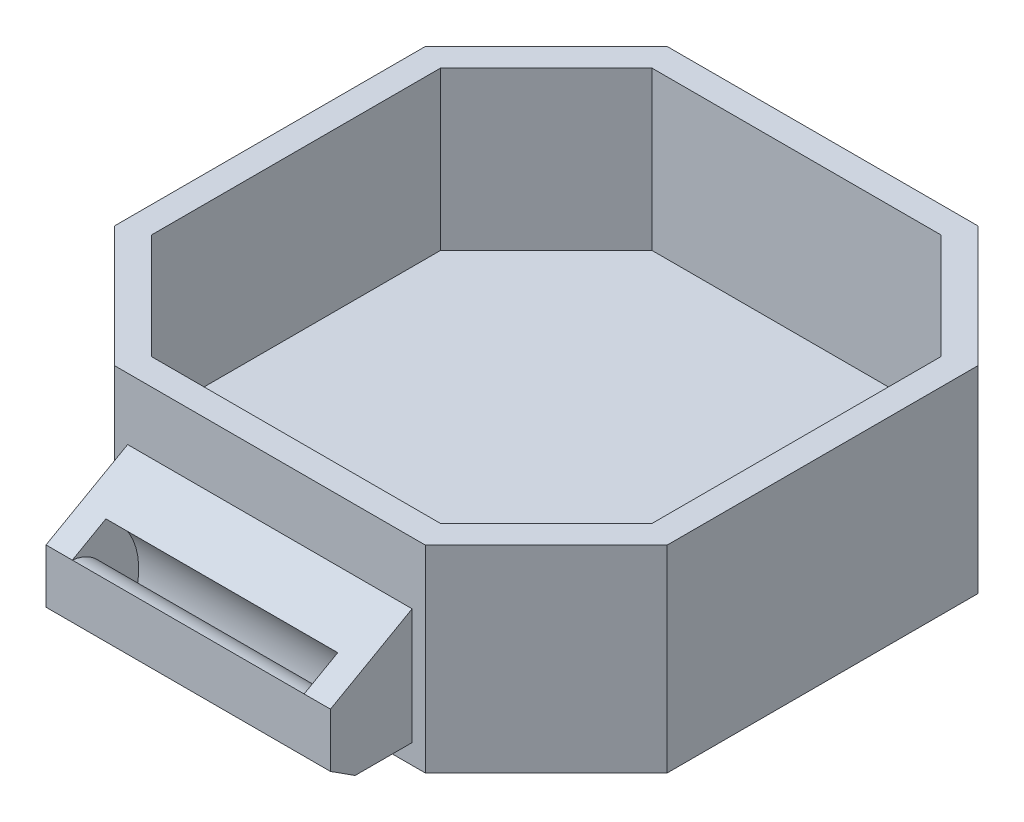
ISO-10303-21;
HEADER;
FILE_DESCRIPTION(('STEP AP214'),'2;1');
FILE_NAME('part.step','',(''),(''),'','','');
FILE_SCHEMA(('AUTOMOTIVE_DESIGN { 1 0 10303 214 1 1 1 1 }'));
ENDSEC;
DATA;
#1=APPLICATION_CONTEXT('core data for automotive mechanical design processes');
#2=APPLICATION_PROTOCOL_DEFINITION('international standard','automotive_design',2000,#1);
#3=PRODUCT_CONTEXT('',#1,'mechanical');
#4=PRODUCT('Part','Part','',(#3));
#5=PRODUCT_RELATED_PRODUCT_CATEGORY('part','',(#4));
#6=PRODUCT_DEFINITION_FORMATION('','',#4);
#7=PRODUCT_DEFINITION_CONTEXT('part definition',#1,'design');
#8=PRODUCT_DEFINITION('design','',#6,#7);
#9=PRODUCT_DEFINITION_SHAPE('','',#8);
#10=(LENGTH_UNIT() NAMED_UNIT(*) SI_UNIT(.MILLI.,.METRE.));
#11=(NAMED_UNIT(*) PLANE_ANGLE_UNIT() SI_UNIT($,.RADIAN.));
#12=(NAMED_UNIT(*) SI_UNIT($,.STERADIAN.) SOLID_ANGLE_UNIT());
#13=UNCERTAINTY_MEASURE_WITH_UNIT(LENGTH_MEASURE(1.E-05),#10,'distance_accuracy_value','');
#14=(GEOMETRIC_REPRESENTATION_CONTEXT(3) GLOBAL_UNCERTAINTY_ASSIGNED_CONTEXT((#13)) GLOBAL_UNIT_ASSIGNED_CONTEXT((#10,
#11,#12)) REPRESENTATION_CONTEXT('',''));
#15=CARTESIAN_POINT('',(0.,0.,0.));
#16=DIRECTION('',(0.,0.,1.));
#17=DIRECTION('',(1.,0.,0.));
#18=AXIS2_PLACEMENT_3D('',#15,#16,#17);
#19=CARTESIAN_POINT('',(-11.8076118445749,15.,21.));
#20=DIRECTION('',(0.,0.,-1.));
#21=DIRECTION('',(-1.,0.,0.));
#22=AXIS2_PLACEMENT_3D('',#19,#20,#21);
#23=PLANE('',#22);
#24=DIRECTION('',(0.,-1.,0.));
#25=VECTOR('',#24,1.);
#26=CARTESIAN_POINT('',(-11.8076118445749,15.,21.));
#27=LINE('',#26,#25);
#28=CARTESIAN_POINT('',(-11.8076118445749,15.,21.));
#29=VERTEX_POINT('',#28);
#30=CARTESIAN_POINT('',(-11.8076118445749,0.,21.));
#31=VERTEX_POINT('',#30);
#32=EDGE_CURVE('E382',#29,#31,#27,.T.);
#33=ORIENTED_EDGE('',*,*,#32,.T.);
#34=DIRECTION('',(1.,0.,0.));
#35=VECTOR('',#34,1.);
#36=CARTESIAN_POINT('',(-11.8076118445749,0.,21.));
#37=LINE('',#36,#35);
#38=CARTESIAN_POINT('',(11.8076118445749,0.,21.));
#39=VERTEX_POINT('',#38);
#40=EDGE_CURVE('E364',#31,#39,#37,.T.);
#41=ORIENTED_EDGE('',*,*,#40,.T.);
#42=DIRECTION('',(0.,-1.,0.));
#43=VECTOR('',#42,1.);
#44=CARTESIAN_POINT('',(11.8076118445749,15.,21.));
#45=LINE('',#44,#43);
#46=CARTESIAN_POINT('',(11.8076118445749,15.,21.));
#47=VERTEX_POINT('',#46);
#48=EDGE_CURVE('E379',#47,#39,#45,.T.);
#49=ORIENTED_EDGE('',*,*,#48,.F.);
#50=DIRECTION('',(1.,0.,0.));
#51=VECTOR('',#50,1.);
#52=CARTESIAN_POINT('',(-11.8076118445749,15.,21.));
#53=LINE('',#52,#51);
#54=EDGE_CURVE('E346',#29,#47,#53,.T.);
#55=ORIENTED_EDGE('',*,*,#54,.F.);
#56=EDGE_LOOP('',(#33,#41,#49,#55));
#57=FACE_BOUND('',#56,.T.);
#58=DIRECTION('',(0.,-1.,0.));
#59=VECTOR('',#58,1.);
#60=CARTESIAN_POINT('',(-10.8076118445749,1.5,21.));
#61=LINE('',#60,#59);
#62=CARTESIAN_POINT('',(-10.8076118445749,10.3040666458553,21.));
#63=VERTEX_POINT('',#62);
#64=CARTESIAN_POINT('',(-10.8076118445749,1.5,21.));
#65=VERTEX_POINT('',#64);
#66=EDGE_CURVE('E258',#63,#65,#61,.T.);
#67=ORIENTED_EDGE('',*,*,#66,.F.);
#68=DIRECTION('',(1.,0.,0.));
#69=VECTOR('',#68,1.);
#70=CARTESIAN_POINT('',(-21.,10.3040666458553,21.));
#71=LINE('',#70,#69);
#72=CARTESIAN_POINT('',(10.8076118445749,10.3040666458553,21.));
#73=VERTEX_POINT('',#72);
#74=EDGE_CURVE('E239',#63,#73,#71,.T.);
#75=ORIENTED_EDGE('',*,*,#74,.T.);
#76=DIRECTION('',(0.,1.,0.));
#77=VECTOR('',#76,1.);
#78=CARTESIAN_POINT('',(10.8076118445749,1.5,21.));
#79=LINE('',#78,#77);
#80=CARTESIAN_POINT('',(10.8076118445749,1.5,21.));
#81=VERTEX_POINT('',#80);
#82=EDGE_CURVE('E263',#81,#73,#79,.T.);
#83=ORIENTED_EDGE('',*,*,#82,.F.);
#84=DIRECTION('',(1.,0.,0.));
#85=VECTOR('',#84,1.);
#86=CARTESIAN_POINT('',(-10.8076118445749,1.5,21.));
#87=LINE('',#86,#85);
#88=EDGE_CURVE('E260',#65,#81,#87,.T.);
#89=ORIENTED_EDGE('',*,*,#88,.F.);
#90=EDGE_LOOP('',(#67,#75,#83,#89));
#91=FACE_BOUND('',#90,.T.);
#92=ADVANCED_FACE('F33',(#57,#91),#23,.F.);
#93=CARTESIAN_POINT('',(11.8076118445749,15.,-21.));
#94=DIRECTION('',(0.,0.,1.));
#95=DIRECTION('',(1.,0.,0.));
#96=AXIS2_PLACEMENT_3D('',#93,#94,#95);
#97=PLANE('',#96);
#98=DIRECTION('',(-1.,0.,0.));
#99=VECTOR('',#98,1.);
#100=CARTESIAN_POINT('',(11.8076118445749,0.,-21.));
#101=LINE('',#100,#99);
#102=CARTESIAN_POINT('',(11.8076118445749,0.,-21.));
#103=VERTEX_POINT('',#102);
#104=CARTESIAN_POINT('',(-11.8076118445749,0.,-21.));
#105=VERTEX_POINT('',#104);
#106=EDGE_CURVE('E321',#103,#105,#101,.T.);
#107=ORIENTED_EDGE('',*,*,#106,.T.);
#108=DIRECTION('',(0.,-1.,0.));
#109=VECTOR('',#108,1.);
#110=CARTESIAN_POINT('',(-11.8076118445749,15.,-21.));
#111=LINE('',#110,#109);
#112=CARTESIAN_POINT('',(-11.8076118445749,15.,-21.));
#113=VERTEX_POINT('',#112);
#114=EDGE_CURVE('E11',#113,#105,#111,.T.);
#115=ORIENTED_EDGE('',*,*,#114,.F.);
#116=DIRECTION('',(-1.,0.,0.));
#117=VECTOR('',#116,1.);
#118=CARTESIAN_POINT('',(11.8076118445749,15.,-21.));
#119=LINE('',#118,#117);
#120=CARTESIAN_POINT('',(11.8076118445749,15.,-21.));
#121=VERTEX_POINT('',#120);
#122=EDGE_CURVE('E336',#121,#113,#119,.T.);
#123=ORIENTED_EDGE('',*,*,#122,.F.);
#124=DIRECTION('',(0.,-1.,0.));
#125=VECTOR('',#124,1.);
#126=CARTESIAN_POINT('',(11.8076118445749,15.,-21.));
#127=LINE('',#126,#125);
#128=EDGE_CURVE('E354',#121,#103,#127,.T.);
#129=ORIENTED_EDGE('',*,*,#128,.T.);
#130=EDGE_LOOP('',(#107,#115,#123,#129));
#131=FACE_BOUND('',#130,.T.);
#132=ADVANCED_FACE('F35',(#131),#97,.F.);
#133=CARTESIAN_POINT('',(-11.8076118445749,15.,-21.));
#134=DIRECTION('',(0.707106781186547,0.,0.707106781186548));
#135=DIRECTION('',(0.707106781186548,0.,-0.707106781186547));
#136=AXIS2_PLACEMENT_3D('',#133,#134,#135);
#137=PLANE('',#136);
#138=DIRECTION('',(-0.707106781186548,0.,0.707106781186547));
#139=VECTOR('',#138,1.);
#140=CARTESIAN_POINT('',(-11.8076118445749,0.,-21.));
#141=LINE('',#140,#139);
#142=CARTESIAN_POINT('',(-21.,0.,-11.8076118445749));
#143=VERTEX_POINT('',#142);
#144=EDGE_CURVE('E357',#105,#143,#141,.T.);
#145=ORIENTED_EDGE('',*,*,#144,.T.);
#146=DIRECTION('',(0.,-1.,0.));
#147=VECTOR('',#146,1.);
#148=CARTESIAN_POINT('',(-21.,15.,-11.8076118445749));
#149=LINE('',#148,#147);
#150=CARTESIAN_POINT('',(-21.,15.,-11.8076118445749));
#151=VERTEX_POINT('',#150);
#152=EDGE_CURVE('E41',#151,#143,#149,.T.);
#153=ORIENTED_EDGE('',*,*,#152,.F.);
#154=DIRECTION('',(-0.707106781186548,0.,0.707106781186547));
#155=VECTOR('',#154,1.);
#156=CARTESIAN_POINT('',(-11.8076118445749,15.,-21.));
#157=LINE('',#156,#155);
#158=EDGE_CURVE('E339',#113,#151,#157,.T.);
#159=ORIENTED_EDGE('',*,*,#158,.F.);
#160=ORIENTED_EDGE('',*,*,#114,.T.);
#161=EDGE_LOOP('',(#145,#153,#159,#160));
#162=FACE_BOUND('',#161,.T.);
#163=ADVANCED_FACE('F410',(#162),#137,.F.);
#164=CARTESIAN_POINT('',(-21.,15.,-11.8076118445749));
#165=DIRECTION('',(1.,0.,0.));
#166=DIRECTION('',(0.,0.,-1.));
#167=AXIS2_PLACEMENT_3D('',#164,#165,#166);
#168=PLANE('',#167);
#169=DIRECTION('',(0.,0.,1.));
#170=VECTOR('',#169,1.);
#171=CARTESIAN_POINT('',(-21.,0.,-11.8076118445749));
#172=LINE('',#171,#170);
#173=CARTESIAN_POINT('',(-21.,0.,11.8076118445749));
#174=VERTEX_POINT('',#173);
#175=EDGE_CURVE('E359',#143,#174,#172,.T.);
#176=ORIENTED_EDGE('',*,*,#175,.T.);
#177=DIRECTION('',(0.,-1.,0.));
#178=VECTOR('',#177,1.);
#179=CARTESIAN_POINT('',(-21.,15.,11.8076118445749));
#180=LINE('',#179,#178);
#181=CARTESIAN_POINT('',(-21.,15.,11.8076118445749));
#182=VERTEX_POINT('',#181);
#183=EDGE_CURVE('E384',#182,#174,#180,.T.);
#184=ORIENTED_EDGE('',*,*,#183,.F.);
#185=DIRECTION('',(0.,0.,1.));
#186=VECTOR('',#185,1.);
#187=CARTESIAN_POINT('',(-21.,15.,-11.8076118445749));
#188=LINE('',#187,#186);
#189=EDGE_CURVE('E342',#151,#182,#188,.T.);
#190=ORIENTED_EDGE('',*,*,#189,.F.);
#191=ORIENTED_EDGE('',*,*,#152,.T.);
#192=EDGE_LOOP('',(#176,#184,#190,#191));
#193=FACE_BOUND('',#192,.T.);
#194=ADVANCED_FACE('F391',(#193),#168,.F.);
#195=CARTESIAN_POINT('',(-21.,15.,11.8076118445749));
#196=DIRECTION('',(0.707106781186548,0.,-0.707106781186547));
#197=DIRECTION('',(-0.707106781186547,0.,-0.707106781186548));
#198=AXIS2_PLACEMENT_3D('',#195,#196,#197);
#199=PLANE('',#198);
#200=DIRECTION('',(0.707106781186547,0.,0.707106781186548));
#201=VECTOR('',#200,1.);
#202=CARTESIAN_POINT('',(-21.,0.,11.8076118445749));
#203=LINE('',#202,#201);
#204=EDGE_CURVE('E361',#174,#31,#203,.T.);
#205=ORIENTED_EDGE('',*,*,#204,.T.);
#206=ORIENTED_EDGE('',*,*,#32,.F.);
#207=DIRECTION('',(0.707106781186547,0.,0.707106781186548));
#208=VECTOR('',#207,1.);
#209=CARTESIAN_POINT('',(-21.,15.,11.8076118445749));
#210=LINE('',#209,#208);
#211=EDGE_CURVE('E344',#182,#29,#210,.T.);
#212=ORIENTED_EDGE('',*,*,#211,.F.);
#213=ORIENTED_EDGE('',*,*,#183,.T.);
#214=EDGE_LOOP('',(#205,#206,#212,#213));
#215=FACE_BOUND('',#214,.T.);
#216=ADVANCED_FACE('F402',(#215),#199,.F.);
#217=CARTESIAN_POINT('',(11.8076118445749,15.,21.));
#218=DIRECTION('',(-0.707106781186547,0.,-0.707106781186548));
#219=DIRECTION('',(-0.707106781186548,0.,0.707106781186547));
#220=AXIS2_PLACEMENT_3D('',#217,#218,#219);
#221=PLANE('',#220);
#222=DIRECTION('',(0.707106781186548,0.,-0.707106781186547));
#223=VECTOR('',#222,1.);
#224=CARTESIAN_POINT('',(11.8076118445749,0.,21.));
#225=LINE('',#224,#223);
#226=CARTESIAN_POINT('',(21.,0.,11.8076118445749));
#227=VERTEX_POINT('',#226);
#228=EDGE_CURVE('E366',#39,#227,#225,.T.);
#229=ORIENTED_EDGE('',*,*,#228,.T.);
#230=DIRECTION('',(0.,-1.,0.));
#231=VECTOR('',#230,1.);
#232=CARTESIAN_POINT('',(21.,15.,11.8076118445749));
#233=LINE('',#232,#231);
#234=CARTESIAN_POINT('',(21.,15.,11.8076118445749));
#235=VERTEX_POINT('',#234);
#236=EDGE_CURVE('E376',#235,#227,#233,.T.);
#237=ORIENTED_EDGE('',*,*,#236,.F.);
#238=DIRECTION('',(0.707106781186548,0.,-0.707106781186547));
#239=VECTOR('',#238,1.);
#240=CARTESIAN_POINT('',(11.8076118445749,15.,21.));
#241=LINE('',#240,#239);
#242=EDGE_CURVE('E348',#47,#235,#241,.T.);
#243=ORIENTED_EDGE('',*,*,#242,.F.);
#244=ORIENTED_EDGE('',*,*,#48,.T.);
#245=EDGE_LOOP('',(#229,#237,#243,#244));
#246=FACE_BOUND('',#245,.T.);
#247=ADVANCED_FACE('F425',(#246),#221,.F.);
#248=CARTESIAN_POINT('',(21.,15.,11.8076118445749));
#249=DIRECTION('',(-1.,0.,0.));
#250=DIRECTION('',(0.,0.,1.));
#251=AXIS2_PLACEMENT_3D('',#248,#249,#250);
#252=PLANE('',#251);
#253=DIRECTION('',(0.,0.,-1.));
#254=VECTOR('',#253,1.);
#255=CARTESIAN_POINT('',(21.,0.,11.8076118445749));
#256=LINE('',#255,#254);
#257=CARTESIAN_POINT('',(21.,0.,-11.8076118445749));
#258=VERTEX_POINT('',#257);
#259=EDGE_CURVE('E368',#227,#258,#256,.T.);
#260=ORIENTED_EDGE('',*,*,#259,.T.);
#261=DIRECTION('',(0.,-1.,0.));
#262=VECTOR('',#261,1.);
#263=CARTESIAN_POINT('',(21.,15.,-11.8076118445749));
#264=LINE('',#263,#262);
#265=CARTESIAN_POINT('',(21.,15.,-11.8076118445749));
#266=VERTEX_POINT('',#265);
#267=EDGE_CURVE('E373',#266,#258,#264,.T.);
#268=ORIENTED_EDGE('',*,*,#267,.F.);
#269=DIRECTION('',(0.,0.,-1.));
#270=VECTOR('',#269,1.);
#271=CARTESIAN_POINT('',(21.,15.,11.8076118445749));
#272=LINE('',#271,#270);
#273=EDGE_CURVE('E350',#235,#266,#272,.T.);
#274=ORIENTED_EDGE('',*,*,#273,.F.);
#275=ORIENTED_EDGE('',*,*,#236,.T.);
#276=EDGE_LOOP('',(#260,#268,#274,#275));
#277=FACE_BOUND('',#276,.T.);
#278=ADVANCED_FACE('F421',(#277),#252,.F.);
#279=CARTESIAN_POINT('',(21.,15.,-11.8076118445749));
#280=DIRECTION('',(-0.707106781186548,0.,0.707106781186547));
#281=DIRECTION('',(0.707106781186547,0.,0.707106781186548));
#282=AXIS2_PLACEMENT_3D('',#279,#280,#281);
#283=PLANE('',#282);
#284=DIRECTION('',(-0.707106781186547,0.,-0.707106781186548));
#285=VECTOR('',#284,1.);
#286=CARTESIAN_POINT('',(21.,0.,-11.8076118445749));
#287=LINE('',#286,#285);
#288=EDGE_CURVE('E340',#258,#103,#287,.T.);
#289=ORIENTED_EDGE('',*,*,#288,.T.);
#290=ORIENTED_EDGE('',*,*,#128,.F.);
#291=DIRECTION('',(-0.707106781186547,0.,-0.707106781186548));
#292=VECTOR('',#291,1.);
#293=CARTESIAN_POINT('',(21.,15.,-11.8076118445749));
#294=LINE('',#293,#292);
#295=EDGE_CURVE('E352',#266,#121,#294,.T.);
#296=ORIENTED_EDGE('',*,*,#295,.F.);
#297=ORIENTED_EDGE('',*,*,#267,.T.);
#298=EDGE_LOOP('',(#289,#290,#296,#297));
#299=FACE_BOUND('',#298,.T.);
#300=ADVANCED_FACE('F416',(#299),#283,.F.);
#301=CARTESIAN_POINT('',(0.,15.,0.));
#302=DIRECTION('',(0.,1.,0.));
#303=DIRECTION('',(0.,0.,1.));
#304=AXIS2_PLACEMENT_3D('',#301,#302,#303);
#305=PLANE('',#304);
#306=DIRECTION('',(-0.707106781186548,0.,0.707106781186548));
#307=VECTOR('',#306,1.);
#308=CARTESIAN_POINT('',(-10.9791847198287,15.,-19.));
#309=LINE('',#308,#307);
#310=CARTESIAN_POINT('',(-10.9791847198287,15.,-19.));
#311=VERTEX_POINT('',#310);
#312=CARTESIAN_POINT('',(-19.,15.,-10.9791847198287));
#313=VERTEX_POINT('',#312);
#314=EDGE_CURVE('E271',#311,#313,#309,.T.);
#315=ORIENTED_EDGE('',*,*,#314,.F.);
#316=DIRECTION('',(-1.,0.,0.));
#317=VECTOR('',#316,1.);
#318=CARTESIAN_POINT('',(10.9791847198287,15.,-19.));
#319=LINE('',#318,#317);
#320=CARTESIAN_POINT('',(10.9791847198287,15.,-19.));
#321=VERTEX_POINT('',#320);
#322=EDGE_CURVE('E276',#321,#311,#319,.T.);
#323=ORIENTED_EDGE('',*,*,#322,.F.);
#324=DIRECTION('',(-0.707106781186547,0.,-0.707106781186548));
#325=VECTOR('',#324,1.);
#326=CARTESIAN_POINT('',(19.,15.,-10.9791847198287));
#327=LINE('',#326,#325);
#328=CARTESIAN_POINT('',(19.,15.,-10.9791847198287));
#329=VERTEX_POINT('',#328);
#330=EDGE_CURVE('E314',#329,#321,#327,.T.);
#331=ORIENTED_EDGE('',*,*,#330,.F.);
#332=DIRECTION('',(0.,0.,-1.));
#333=VECTOR('',#332,1.);
#334=CARTESIAN_POINT('',(19.,15.,10.9791847198287));
#335=LINE('',#334,#333);
#336=CARTESIAN_POINT('',(19.,15.,10.9791847198287));
#337=VERTEX_POINT('',#336);
#338=EDGE_CURVE('E311',#337,#329,#335,.T.);
#339=ORIENTED_EDGE('',*,*,#338,.F.);
#340=DIRECTION('',(0.707106781186548,0.,-0.707106781186547));
#341=VECTOR('',#340,1.);
#342=CARTESIAN_POINT('',(10.9791847198287,15.,19.));
#343=LINE('',#342,#341);
#344=CARTESIAN_POINT('',(10.9791847198287,15.,19.));
#345=VERTEX_POINT('',#344);
#346=EDGE_CURVE('E308',#345,#337,#343,.T.);
#347=ORIENTED_EDGE('',*,*,#346,.F.);
#348=DIRECTION('',(1.,0.,0.));
#349=VECTOR('',#348,1.);
#350=CARTESIAN_POINT('',(-10.9791847198287,15.,19.));
#351=LINE('',#350,#349);
#352=CARTESIAN_POINT('',(-10.9791847198287,15.,19.));
#353=VERTEX_POINT('',#352);
#354=EDGE_CURVE('E305',#353,#345,#351,.T.);
#355=ORIENTED_EDGE('',*,*,#354,.F.);
#356=DIRECTION('',(0.707106781186547,0.,0.707106781186548));
#357=VECTOR('',#356,1.);
#358=CARTESIAN_POINT('',(-19.,15.,10.9791847198287));
#359=LINE('',#358,#357);
#360=CARTESIAN_POINT('',(-19.,15.,10.9791847198287));
#361=VERTEX_POINT('',#360);
#362=EDGE_CURVE('E302',#361,#353,#359,.T.);
#363=ORIENTED_EDGE('',*,*,#362,.F.);
#364=DIRECTION('',(0.,0.,1.));
#365=VECTOR('',#364,1.);
#366=CARTESIAN_POINT('',(-19.,15.,-10.9791847198287));
#367=LINE('',#366,#365);
#368=EDGE_CURVE('E299',#313,#361,#367,.T.);
#369=ORIENTED_EDGE('',*,*,#368,.F.);
#370=EDGE_LOOP('',(#315,#323,#331,#339,#347,#355,#363,#369));
#371=FACE_BOUND('',#370,.T.);
#372=ORIENTED_EDGE('',*,*,#122,.T.);
#373=ORIENTED_EDGE('',*,*,#158,.T.);
#374=ORIENTED_EDGE('',*,*,#189,.T.);
#375=ORIENTED_EDGE('',*,*,#211,.T.);
#376=ORIENTED_EDGE('',*,*,#54,.T.);
#377=ORIENTED_EDGE('',*,*,#242,.T.);
#378=ORIENTED_EDGE('',*,*,#273,.T.);
#379=ORIENTED_EDGE('',*,*,#295,.T.);
#380=EDGE_LOOP('',(#372,#373,#374,#375,#376,#377,#378,#379));
#381=FACE_BOUND('',#380,.T.);
#382=ADVANCED_FACE('F406',(#371,#381),#305,.T.);
#383=CARTESIAN_POINT('',(0.,0.,0.));
#384=DIRECTION('',(0.,1.,0.));
#385=DIRECTION('',(0.,0.,1.));
#386=AXIS2_PLACEMENT_3D('',#383,#384,#385);
#387=PLANE('',#386);
#388=ORIENTED_EDGE('',*,*,#106,.F.);
#389=ORIENTED_EDGE('',*,*,#288,.F.);
#390=ORIENTED_EDGE('',*,*,#259,.F.);
#391=ORIENTED_EDGE('',*,*,#228,.F.);
#392=ORIENTED_EDGE('',*,*,#40,.F.);
#393=ORIENTED_EDGE('',*,*,#204,.F.);
#394=ORIENTED_EDGE('',*,*,#175,.F.);
#395=ORIENTED_EDGE('',*,*,#144,.F.);
#396=EDGE_LOOP('',(#388,#389,#390,#391,#392,#393,#394,#395));
#397=FACE_BOUND('',#396,.T.);
#398=ADVANCED_FACE('F397',(#397),#387,.F.);
#399=CARTESIAN_POINT('',(-10.9791847198287,3.,-19.));
#400=DIRECTION('',(-0.707106781186547,0.,-0.707106781186548));
#401=DIRECTION('',(-0.707106781186548,0.,0.707106781186547));
#402=AXIS2_PLACEMENT_3D('',#399,#400,#401);
#403=PLANE('',#402);
#404=ORIENTED_EDGE('',*,*,#314,.T.);
#405=DIRECTION('',(0.,1.,0.));
#406=VECTOR('',#405,1.);
#407=CARTESIAN_POINT('',(-19.,3.,-10.9791847198287));
#408=LINE('',#407,#406);
#409=CARTESIAN_POINT('',(-19.,3.,-10.9791847198287));
#410=VERTEX_POINT('',#409);
#411=EDGE_CURVE('E297',#410,#313,#408,.T.);
#412=ORIENTED_EDGE('',*,*,#411,.F.);
#413=DIRECTION('',(-0.707106781186548,0.,0.707106781186548));
#414=VECTOR('',#413,1.);
#415=CARTESIAN_POINT('',(-10.9791847198287,3.,-19.));
#416=LINE('',#415,#414);
#417=CARTESIAN_POINT('',(-10.9791847198287,3.,-19.));
#418=VERTEX_POINT('',#417);
#419=EDGE_CURVE('E272',#418,#410,#416,.T.);
#420=ORIENTED_EDGE('',*,*,#419,.F.);
#421=DIRECTION('',(0.,1.,0.));
#422=VECTOR('',#421,1.);
#423=CARTESIAN_POINT('',(-10.9791847198287,3.,-19.));
#424=LINE('',#423,#422);
#425=EDGE_CURVE('E319',#418,#311,#424,.T.);
#426=ORIENTED_EDGE('',*,*,#425,.T.);
#427=EDGE_LOOP('',(#404,#412,#420,#426));
#428=FACE_BOUND('',#427,.T.);
#429=ADVANCED_FACE('F476',(#428),#403,.F.);
#430=CARTESIAN_POINT('',(10.9791847198287,3.,-19.));
#431=DIRECTION('',(0.,0.,-1.));
#432=DIRECTION('',(-1.,0.,0.));
#433=AXIS2_PLACEMENT_3D('',#430,#431,#432);
#434=PLANE('',#433);
#435=ORIENTED_EDGE('',*,*,#322,.T.);
#436=ORIENTED_EDGE('',*,*,#425,.F.);
#437=DIRECTION('',(-1.,0.,0.));
#438=VECTOR('',#437,1.);
#439=CARTESIAN_POINT('',(10.9791847198287,3.,-19.));
#440=LINE('',#439,#438);
#441=CARTESIAN_POINT('',(10.9791847198287,3.,-19.));
#442=VERTEX_POINT('',#441);
#443=EDGE_CURVE('E294',#442,#418,#440,.T.);
#444=ORIENTED_EDGE('',*,*,#443,.F.);
#445=DIRECTION('',(0.,1.,0.));
#446=VECTOR('',#445,1.);
#447=CARTESIAN_POINT('',(10.9791847198287,3.,-19.));
#448=LINE('',#447,#446);
#449=EDGE_CURVE('E322',#442,#321,#448,.T.);
#450=ORIENTED_EDGE('',*,*,#449,.T.);
#451=EDGE_LOOP('',(#435,#436,#444,#450));
#452=FACE_BOUND('',#451,.T.);
#453=ADVANCED_FACE('F472',(#452),#434,.F.);
#454=CARTESIAN_POINT('',(19.,3.,-10.9791847198287));
#455=DIRECTION('',(0.707106781186548,0.,-0.707106781186547));
#456=DIRECTION('',(-0.707106781186547,0.,-0.707106781186548));
#457=AXIS2_PLACEMENT_3D('',#454,#455,#456);
#458=PLANE('',#457);
#459=ORIENTED_EDGE('',*,*,#330,.T.);
#460=ORIENTED_EDGE('',*,*,#449,.F.);
#461=DIRECTION('',(-0.707106781186547,0.,-0.707106781186548));
#462=VECTOR('',#461,1.);
#463=CARTESIAN_POINT('',(19.,3.,-10.9791847198287));
#464=LINE('',#463,#462);
#465=CARTESIAN_POINT('',(19.,3.,-10.9791847198287));
#466=VERTEX_POINT('',#465);
#467=EDGE_CURVE('E291',#466,#442,#464,.T.);
#468=ORIENTED_EDGE('',*,*,#467,.F.);
#469=DIRECTION('',(0.,1.,0.));
#470=VECTOR('',#469,1.);
#471=CARTESIAN_POINT('',(19.,3.,-10.9791847198287));
#472=LINE('',#471,#470);
#473=EDGE_CURVE('E324',#466,#329,#472,.T.);
#474=ORIENTED_EDGE('',*,*,#473,.T.);
#475=EDGE_LOOP('',(#459,#460,#468,#474));
#476=FACE_BOUND('',#475,.T.);
#477=ADVANCED_FACE('F475',(#476),#458,.F.);
#478=CARTESIAN_POINT('',(19.,3.,10.9791847198287));
#479=DIRECTION('',(1.,0.,0.));
#480=DIRECTION('',(0.,0.,-1.));
#481=AXIS2_PLACEMENT_3D('',#478,#479,#480);
#482=PLANE('',#481);
#483=ORIENTED_EDGE('',*,*,#338,.T.);
#484=ORIENTED_EDGE('',*,*,#473,.F.);
#485=DIRECTION('',(0.,0.,-1.));
#486=VECTOR('',#485,1.);
#487=CARTESIAN_POINT('',(19.,3.,10.9791847198287));
#488=LINE('',#487,#486);
#489=CARTESIAN_POINT('',(19.,3.,10.9791847198287));
#490=VERTEX_POINT('',#489);
#491=EDGE_CURVE('E288',#490,#466,#488,.T.);
#492=ORIENTED_EDGE('',*,*,#491,.F.);
#493=DIRECTION('',(0.,1.,0.));
#494=VECTOR('',#493,1.);
#495=CARTESIAN_POINT('',(19.,3.,10.9791847198287));
#496=LINE('',#495,#494);
#497=EDGE_CURVE('E326',#490,#337,#496,.T.);
#498=ORIENTED_EDGE('',*,*,#497,.T.);
#499=EDGE_LOOP('',(#483,#484,#492,#498));
#500=FACE_BOUND('',#499,.T.);
#501=ADVANCED_FACE('F480',(#500),#482,.F.);
#502=CARTESIAN_POINT('',(10.9791847198287,3.,19.));
#503=DIRECTION('',(0.707106781186547,0.,0.707106781186548));
#504=DIRECTION('',(0.707106781186548,0.,-0.707106781186547));
#505=AXIS2_PLACEMENT_3D('',#502,#503,#504);
#506=PLANE('',#505);
#507=ORIENTED_EDGE('',*,*,#346,.T.);
#508=ORIENTED_EDGE('',*,*,#497,.F.);
#509=DIRECTION('',(0.707106781186548,0.,-0.707106781186547));
#510=VECTOR('',#509,1.);
#511=CARTESIAN_POINT('',(10.9791847198287,3.,19.));
#512=LINE('',#511,#510);
#513=CARTESIAN_POINT('',(10.9791847198287,3.,19.));
#514=VERTEX_POINT('',#513);
#515=EDGE_CURVE('E285',#514,#490,#512,.T.);
#516=ORIENTED_EDGE('',*,*,#515,.F.);
#517=DIRECTION('',(0.,1.,0.));
#518=VECTOR('',#517,1.);
#519=CARTESIAN_POINT('',(10.9791847198287,3.,19.));
#520=LINE('',#519,#518);
#521=EDGE_CURVE('E328',#514,#345,#520,.T.);
#522=ORIENTED_EDGE('',*,*,#521,.T.);
#523=EDGE_LOOP('',(#507,#508,#516,#522));
#524=FACE_BOUND('',#523,.T.);
#525=ADVANCED_FACE('F484',(#524),#506,.F.);
#526=CARTESIAN_POINT('',(-10.9791847198287,3.,19.));
#527=DIRECTION('',(0.,0.,1.));
#528=DIRECTION('',(1.,0.,0.));
#529=AXIS2_PLACEMENT_3D('',#526,#527,#528);
#530=PLANE('',#529);
#531=ORIENTED_EDGE('',*,*,#354,.T.);
#532=ORIENTED_EDGE('',*,*,#521,.F.);
#533=DIRECTION('',(1.,0.,0.));
#534=VECTOR('',#533,1.);
#535=CARTESIAN_POINT('',(-10.9791847198287,3.,19.));
#536=LINE('',#535,#534);
#537=CARTESIAN_POINT('',(-10.9791847198287,3.,19.));
#538=VERTEX_POINT('',#537);
#539=EDGE_CURVE('E282',#538,#514,#536,.T.);
#540=ORIENTED_EDGE('',*,*,#539,.F.);
#541=DIRECTION('',(0.,1.,0.));
#542=VECTOR('',#541,1.);
#543=CARTESIAN_POINT('',(-10.9791847198287,3.,19.));
#544=LINE('',#543,#542);
#545=EDGE_CURVE('E330',#538,#353,#544,.T.);
#546=ORIENTED_EDGE('',*,*,#545,.T.);
#547=EDGE_LOOP('',(#531,#532,#540,#546));
#548=FACE_BOUND('',#547,.T.);
#549=ADVANCED_FACE('F488',(#548),#530,.F.);
#550=CARTESIAN_POINT('',(-19.,3.,10.9791847198287));
#551=DIRECTION('',(-0.707106781186548,0.,0.707106781186547));
#552=DIRECTION('',(0.707106781186547,0.,0.707106781186548));
#553=AXIS2_PLACEMENT_3D('',#550,#551,#552);
#554=PLANE('',#553);
#555=ORIENTED_EDGE('',*,*,#362,.T.);
#556=ORIENTED_EDGE('',*,*,#545,.F.);
#557=DIRECTION('',(0.707106781186547,0.,0.707106781186548));
#558=VECTOR('',#557,1.);
#559=CARTESIAN_POINT('',(-19.,3.,10.9791847198287));
#560=LINE('',#559,#558);
#561=CARTESIAN_POINT('',(-19.,3.,10.9791847198287));
#562=VERTEX_POINT('',#561);
#563=EDGE_CURVE('E279',#562,#538,#560,.T.);
#564=ORIENTED_EDGE('',*,*,#563,.F.);
#565=DIRECTION('',(0.,1.,0.));
#566=VECTOR('',#565,1.);
#567=CARTESIAN_POINT('',(-19.,3.,10.9791847198287));
#568=LINE('',#567,#566);
#569=EDGE_CURVE('E332',#562,#361,#568,.T.);
#570=ORIENTED_EDGE('',*,*,#569,.T.);
#571=EDGE_LOOP('',(#555,#556,#564,#570));
#572=FACE_BOUND('',#571,.T.);
#573=ADVANCED_FACE('F492',(#572),#554,.F.);
#574=CARTESIAN_POINT('',(-19.,3.,-10.9791847198287));
#575=DIRECTION('',(-1.,0.,0.));
#576=DIRECTION('',(0.,0.,1.));
#577=AXIS2_PLACEMENT_3D('',#574,#575,#576);
#578=PLANE('',#577);
#579=ORIENTED_EDGE('',*,*,#368,.T.);
#580=ORIENTED_EDGE('',*,*,#569,.F.);
#581=DIRECTION('',(0.,0.,1.));
#582=VECTOR('',#581,1.);
#583=CARTESIAN_POINT('',(-19.,3.,-10.9791847198287));
#584=LINE('',#583,#582);
#585=EDGE_CURVE('E275',#410,#562,#584,.T.);
#586=ORIENTED_EDGE('',*,*,#585,.F.);
#587=ORIENTED_EDGE('',*,*,#411,.T.);
#588=EDGE_LOOP('',(#579,#580,#586,#587));
#589=FACE_BOUND('',#588,.T.);
#590=ADVANCED_FACE('F470',(#589),#578,.F.);
#591=CARTESIAN_POINT('',(0.,3.,0.));
#592=DIRECTION('',(0.,1.,0.));
#593=DIRECTION('',(0.,0.,1.));
#594=AXIS2_PLACEMENT_3D('',#591,#592,#593);
#595=PLANE('',#594);
#596=ORIENTED_EDGE('',*,*,#419,.T.);
#597=ORIENTED_EDGE('',*,*,#585,.T.);
#598=ORIENTED_EDGE('',*,*,#563,.T.);
#599=ORIENTED_EDGE('',*,*,#539,.T.);
#600=ORIENTED_EDGE('',*,*,#515,.T.);
#601=ORIENTED_EDGE('',*,*,#491,.T.);
#602=ORIENTED_EDGE('',*,*,#467,.T.);
#603=ORIENTED_EDGE('',*,*,#443,.T.);
#604=EDGE_LOOP('',(#596,#597,#598,#599,#600,#601,#602,#603));
#605=FACE_BOUND('',#604,.T.);
#606=ADVANCED_FACE('F467',(#605),#595,.T.);
#607=CARTESIAN_POINT('',(-10.8076118445749,1.5,33.));
#608=DIRECTION('',(1.,0.,0.));
#609=DIRECTION('',(0.,0.,-1.));
#610=AXIS2_PLACEMENT_3D('',#607,#608,#609);
#611=PLANE('',#610);
#612=DIRECTION('',(0.,1.,0.));
#613=VECTOR('',#612,1.);
#614=CARTESIAN_POINT('',(-10.8076118445749,1.5,27.2042265476319));
#615=LINE('',#614,#613);
#616=CARTESIAN_POINT('',(-10.8076118445749,2.70256598486067,27.2042265476319));
#617=VERTEX_POINT('',#616);
#618=CARTESIAN_POINT('',(-10.8076118445749,6.80274711709056,27.2042265476319));
#619=VERTEX_POINT('',#618);
#620=EDGE_CURVE('E252',#617,#619,#615,.T.);
#621=ORIENTED_EDGE('',*,*,#620,.T.);
#622=DIRECTION('',(0.,0.491480845404924,-0.870888384696949));
#623=VECTOR('',#622,1.);
#624=CARTESIAN_POINT('',(-10.8076118445749,3.04111471054566,33.8697192132934));
#625=LINE('',#624,#623);
#626=EDGE_CURVE('E255',#619,#63,#625,.T.);
#627=ORIENTED_EDGE('',*,*,#626,.T.);
#628=ORIENTED_EDGE('',*,*,#66,.T.);
#629=DIRECTION('',(0.,0.,-1.));
#630=VECTOR('',#629,1.);
#631=CARTESIAN_POINT('',(-10.8076118445749,1.5,33.));
#632=LINE('',#631,#630);
#633=CARTESIAN_POINT('',(-10.8076118445749,1.5,25.3317028809443));
#634=VERTEX_POINT('',#633);
#635=EDGE_CURVE('E268',#634,#65,#632,.T.);
#636=ORIENTED_EDGE('',*,*,#635,.F.);
#637=DIRECTION('',(0.,0.540376236543751,0.84142350988002));
#638=VECTOR('',#637,1.);
#639=CARTESIAN_POINT('',(-10.8076118445749,4.98666174301516,30.7608075735128));
#640=LINE('',#639,#638);
#641=EDGE_CURVE('E241',#634,#617,#640,.T.);
#642=ORIENTED_EDGE('',*,*,#641,.T.);
#643=EDGE_LOOP('',(#621,#627,#628,#636,#642));
#644=FACE_BOUND('',#643,.T.);
#645=ADVANCED_FACE('F435',(#644),#611,.F.);
#646=CARTESIAN_POINT('',(-10.8076118445749,1.5,33.));
#647=DIRECTION('',(0.,1.,0.));
#648=DIRECTION('',(0.,0.,1.));
#649=AXIS2_PLACEMENT_3D('',#646,#647,#648);
#650=PLANE('',#649);
#651=DIRECTION('',(1.,0.,0.));
#652=VECTOR('',#651,1.);
#653=CARTESIAN_POINT('',(-17.2301415219385,1.5,22.6305703951062));
#654=LINE('',#653,#652);
#655=CARTESIAN_POINT('',(-8.80761184457489,1.5,22.6305703951062));
#656=VERTEX_POINT('',#655);
#657=CARTESIAN_POINT('',(8.80761184457488,1.5,22.6305703951062));
#658=VERTEX_POINT('',#657);
#659=EDGE_CURVE('E204',#656,#658,#654,.T.);
#660=ORIENTED_EDGE('',*,*,#659,.F.);
#661=DIRECTION('',(0.,0.,-1.));
#662=VECTOR('',#661,1.);
#663=CARTESIAN_POINT('',(-8.80761184457489,1.5,25.3317028809443));
#664=LINE('',#663,#662);
#665=CARTESIAN_POINT('',(-8.80761184457489,1.5,25.3317028809443));
#666=VERTEX_POINT('',#665);
#667=EDGE_CURVE('E210',#666,#656,#664,.T.);
#668=ORIENTED_EDGE('',*,*,#667,.F.);
#669=DIRECTION('',(1.,0.,0.));
#670=VECTOR('',#669,1.);
#671=CARTESIAN_POINT('',(-21.,1.5,25.3317028809443));
#672=LINE('',#671,#670);
#673=EDGE_CURVE('E248',#634,#666,#672,.T.);
#674=ORIENTED_EDGE('',*,*,#673,.F.);
#675=ORIENTED_EDGE('',*,*,#635,.T.);
#676=ORIENTED_EDGE('',*,*,#88,.T.);
#677=DIRECTION('',(0.,0.,-1.));
#678=VECTOR('',#677,1.);
#679=CARTESIAN_POINT('',(10.8076118445749,1.5,33.));
#680=LINE('',#679,#678);
#681=CARTESIAN_POINT('',(10.8076118445749,1.5,25.3317028809443));
#682=VERTEX_POINT('',#681);
#683=EDGE_CURVE('E266',#682,#81,#680,.T.);
#684=ORIENTED_EDGE('',*,*,#683,.F.);
#685=CARTESIAN_POINT('',(8.80761184457488,1.5,25.3317028809443));
#686=VERTEX_POINT('',#685);
#687=EDGE_CURVE('E238',#686,#682,#672,.T.);
#688=ORIENTED_EDGE('',*,*,#687,.F.);
#689=DIRECTION('',(0.,0.,-1.));
#690=VECTOR('',#689,1.);
#691=CARTESIAN_POINT('',(8.80761184457488,1.5,25.3317028809443));
#692=LINE('',#691,#690);
#693=EDGE_CURVE('E221',#686,#658,#692,.T.);
#694=ORIENTED_EDGE('',*,*,#693,.T.);
#695=EDGE_LOOP('',(#660,#668,#674,#675,#676,#684,#688,#694));
#696=FACE_BOUND('',#695,.T.);
#697=ADVANCED_FACE('F219',(#696),#650,.F.);
#698=CARTESIAN_POINT('',(10.8076118445749,1.5,33.));
#699=DIRECTION('',(-1.,0.,0.));
#700=DIRECTION('',(0.,0.,1.));
#701=AXIS2_PLACEMENT_3D('',#698,#699,#700);
#702=PLANE('',#701);
#703=ORIENTED_EDGE('',*,*,#82,.T.);
#704=DIRECTION('',(0.,0.491480845404924,-0.870888384696949));
#705=VECTOR('',#704,1.);
#706=CARTESIAN_POINT('',(10.8076118445749,6.80274711709056,27.2042265476319));
#707=LINE('',#706,#705);
#708=CARTESIAN_POINT('',(10.8076118445749,6.80274711709056,27.2042265476319));
#709=VERTEX_POINT('',#708);
#710=EDGE_CURVE('E235',#709,#73,#707,.T.);
#711=ORIENTED_EDGE('',*,*,#710,.F.);
#712=DIRECTION('',(0.,1.,0.));
#713=VECTOR('',#712,1.);
#714=CARTESIAN_POINT('',(10.8076118445749,2.70256598486067,27.2042265476319));
#715=LINE('',#714,#713);
#716=CARTESIAN_POINT('',(10.8076118445749,2.70256598486067,27.2042265476319));
#717=VERTEX_POINT('',#716);
#718=EDGE_CURVE('E232',#717,#709,#715,.T.);
#719=ORIENTED_EDGE('',*,*,#718,.F.);
#720=DIRECTION('',(0.,0.540376236543751,0.84142350988002));
#721=VECTOR('',#720,1.);
#722=CARTESIAN_POINT('',(10.8076118445749,1.5,25.3317028809443));
#723=LINE('',#722,#721);
#724=EDGE_CURVE('E229',#682,#717,#723,.T.);
#725=ORIENTED_EDGE('',*,*,#724,.F.);
#726=ORIENTED_EDGE('',*,*,#683,.T.);
#727=EDGE_LOOP('',(#703,#711,#719,#725,#726));
#728=FACE_BOUND('',#727,.T.);
#729=ADVANCED_FACE('F452',(#728),#702,.F.);
#730=CARTESIAN_POINT('',(-21.,6.80274711709056,27.2042265476319));
#731=DIRECTION('',(0.,-0.870888384696949,-0.491480845404924));
#732=DIRECTION('',(0.,0.491480845404924,-0.870888384696949));
#733=AXIS2_PLACEMENT_3D('',#730,#731,#732);
#734=PLANE('',#733);
#735=DIRECTION('',(1.,0.,0.));
#736=VECTOR('',#735,1.);
#737=CARTESIAN_POINT('',(-21.,6.80274711709056,27.2042265476319));
#738=LINE('',#737,#736);
#739=CARTESIAN_POINT('',(-8.80761184457489,6.80274711709056,27.2042265476319));
#740=VERTEX_POINT('',#739);
#741=EDGE_CURVE('E242',#619,#740,#738,.T.);
#742=ORIENTED_EDGE('',*,*,#741,.T.);
#743=DIRECTION('',(0.,-0.491480845404924,0.870888384696949));
#744=VECTOR('',#743,1.);
#745=CARTESIAN_POINT('',(-8.80761184457489,6.80274711709056,27.2042265476319));
#746=LINE('',#745,#744);
#747=CARTESIAN_POINT('',(-8.80761184457489,8.24297528645988,24.6521881604925));
#748=VERTEX_POINT('',#747);
#749=EDGE_CURVE('E48',#748,#740,#746,.T.);
#750=ORIENTED_EDGE('',*,*,#749,.F.);
#751=DIRECTION('',(1.,0.,0.));
#752=VECTOR('',#751,1.);
#753=CARTESIAN_POINT('',(-17.2301415219385,8.24297528645988,24.6521881604925));
#754=LINE('',#753,#752);
#755=CARTESIAN_POINT('',(8.80761184457488,8.24297528645988,24.6521881604925));
#756=VERTEX_POINT('',#755);
#757=EDGE_CURVE('E207',#748,#756,#754,.T.);
#758=ORIENTED_EDGE('',*,*,#757,.T.);
#759=DIRECTION('',(0.,-0.491480845404924,0.870888384696949));
#760=VECTOR('',#759,1.);
#761=CARTESIAN_POINT('',(8.80761184457488,6.80274711709056,27.2042265476319));
#762=LINE('',#761,#760);
#763=CARTESIAN_POINT('',(8.80761184457488,6.80274711709056,27.2042265476319));
#764=VERTEX_POINT('',#763);
#765=EDGE_CURVE('E216',#756,#764,#762,.T.);
#766=ORIENTED_EDGE('',*,*,#765,.T.);
#767=EDGE_CURVE('E245',#764,#709,#738,.T.);
#768=ORIENTED_EDGE('',*,*,#767,.T.);
#769=ORIENTED_EDGE('',*,*,#710,.T.);
#770=ORIENTED_EDGE('',*,*,#74,.F.);
#771=ORIENTED_EDGE('',*,*,#626,.F.);
#772=EDGE_LOOP('',(#742,#750,#758,#766,#768,#769,#770,#771));
#773=FACE_BOUND('',#772,.T.);
#774=ADVANCED_FACE('F447',(#773),#734,.F.);
#775=CARTESIAN_POINT('',(-21.,2.70256598486067,27.2042265476319));
#776=DIRECTION('',(0.,0.,-1.));
#777=DIRECTION('',(-1.,0.,0.));
#778=AXIS2_PLACEMENT_3D('',#775,#776,#777);
#779=PLANE('',#778);
#780=DIRECTION('',(1.,0.,0.));
#781=VECTOR('',#780,1.);
#782=CARTESIAN_POINT('',(-21.,2.70256598486067,27.2042265476319));
#783=LINE('',#782,#781);
#784=EDGE_CURVE('E246',#617,#717,#783,.T.);
#785=ORIENTED_EDGE('',*,*,#784,.T.);
#786=ORIENTED_EDGE('',*,*,#718,.T.);
#787=ORIENTED_EDGE('',*,*,#767,.F.);
#788=DIRECTION('',(1.,0.,0.));
#789=VECTOR('',#788,1.);
#790=CARTESIAN_POINT('',(-17.2301415219385,6.80274711709056,27.2042265476319));
#791=LINE('',#790,#789);
#792=EDGE_CURVE('E445',#740,#764,#791,.T.);
#793=ORIENTED_EDGE('',*,*,#792,.F.);
#794=ORIENTED_EDGE('',*,*,#741,.F.);
#795=ORIENTED_EDGE('',*,*,#620,.F.);
#796=EDGE_LOOP('',(#785,#786,#787,#793,#794,#795));
#797=FACE_BOUND('',#796,.T.);
#798=ADVANCED_FACE('F442',(#797),#779,.F.);
#799=CARTESIAN_POINT('',(-21.,1.5,25.3317028809443));
#800=DIRECTION('',(0.,0.84142350988002,-0.540376236543751));
#801=DIRECTION('',(0.,0.540376236543751,0.84142350988002));
#802=AXIS2_PLACEMENT_3D('',#799,#800,#801);
#803=PLANE('',#802);
#804=ORIENTED_EDGE('',*,*,#673,.T.);
#805=DIRECTION('',(1.,0.,0.));
#806=VECTOR('',#805,1.);
#807=CARTESIAN_POINT('',(-17.2301415219385,1.5,25.3317028809443));
#808=LINE('',#807,#806);
#809=EDGE_CURVE('E226',#666,#686,#808,.T.);
#810=ORIENTED_EDGE('',*,*,#809,.T.);
#811=ORIENTED_EDGE('',*,*,#687,.T.);
#812=ORIENTED_EDGE('',*,*,#724,.T.);
#813=ORIENTED_EDGE('',*,*,#784,.F.);
#814=ORIENTED_EDGE('',*,*,#641,.F.);
#815=EDGE_LOOP('',(#804,#810,#811,#812,#813,#814));
#816=FACE_BOUND('',#815,.T.);
#817=ADVANCED_FACE('F438',(#816),#803,.F.);
#818=CARTESIAN_POINT('',(-8.80761184457489,0.,0.));
#819=DIRECTION('',(-1.,0.,0.));
#820=DIRECTION('',(0.,0.,1.));
#821=AXIS2_PLACEMENT_3D('',#818,#819,#820);
#822=PLANE('',#821);
#823=CARTESIAN_POINT('',(-8.80761184457489,3.7051706114799,27.5315542930376));
#824=DIRECTION('',(-1.,0.,0.));
#825=DIRECTION('',(0.,0.,1.));
#826=AXIS2_PLACEMENT_3D('',#823,#824,#825);
#827=CIRCLE('',#826,3.11482321505145);
#828=EDGE_CURVE('E212',#740,#666,#827,.T.);
#829=ORIENTED_EDGE('',*,*,#828,.T.);
#830=ORIENTED_EDGE('',*,*,#667,.T.);
#831=CARTESIAN_POINT('',(-8.80761184457489,3.7051706114799,27.5315542930376));
#832=DIRECTION('',(-1.,0.,0.));
#833=DIRECTION('',(0.,0.,1.));
#834=AXIS2_PLACEMENT_3D('',#831,#832,#833);
#835=CIRCLE('',#834,5.37423674520553);
#836=EDGE_CURVE('E200',#656,#748,#835,.F.);
#837=ORIENTED_EDGE('',*,*,#836,.T.);
#838=ORIENTED_EDGE('',*,*,#749,.T.);
#839=EDGE_LOOP('',(#829,#830,#837,#838));
#840=FACE_BOUND('',#839,.T.);
#841=ADVANCED_FACE('F211',(#840),#822,.F.);
#842=CARTESIAN_POINT('',(8.80761184457488,3.7051706114799,27.5315542930376));
#843=DIRECTION('',(-1.,0.,0.));
#844=DIRECTION('',(0.,0.,1.));
#845=AXIS2_PLACEMENT_3D('',#842,#843,#844);
#846=PLANE('',#845);
#847=CARTESIAN_POINT('',(8.80761184457488,3.7051706114799,27.5315542930376));
#848=DIRECTION('',(-1.,0.,0.));
#849=DIRECTION('',(0.,0.,1.));
#850=AXIS2_PLACEMENT_3D('',#847,#848,#849);
#851=CIRCLE('',#850,3.11482321505145);
#852=EDGE_CURVE('E56',#764,#686,#851,.T.);
#853=ORIENTED_EDGE('',*,*,#852,.F.);
#854=ORIENTED_EDGE('',*,*,#765,.F.);
#855=CARTESIAN_POINT('',(8.80761184457488,3.7051706114799,27.5315542930376));
#856=DIRECTION('',(1.,0.,0.));
#857=DIRECTION('',(0.,0.,1.));
#858=AXIS2_PLACEMENT_3D('',#855,#856,#857);
#859=CIRCLE('',#858,5.37423674520553);
#860=EDGE_CURVE('E617',#658,#756,#859,.T.);
#861=ORIENTED_EDGE('',*,*,#860,.F.);
#862=ORIENTED_EDGE('',*,*,#693,.F.);
#863=EDGE_LOOP('',(#853,#854,#861,#862));
#864=FACE_BOUND('',#863,.T.);
#865=ADVANCED_FACE('F585',(#864),#846,.T.);
#866=CARTESIAN_POINT('',(-17.2301415219385,3.7051706114799,27.5315542930376));
#867=DIRECTION('',(1.,0.,0.));
#868=DIRECTION('',(0.,0.,-1.));
#869=AXIS2_PLACEMENT_3D('',#866,#867,#868);
#870=CYLINDRICAL_SURFACE('',#869,5.37423674520553);
#871=ORIENTED_EDGE('',*,*,#659,.T.);
#872=ORIENTED_EDGE('',*,*,#860,.T.);
#873=ORIENTED_EDGE('',*,*,#757,.F.);
#874=ORIENTED_EDGE('',*,*,#836,.F.);
#875=EDGE_LOOP('',(#871,#872,#873,#874));
#876=FACE_BOUND('',#875,.T.);
#877=ADVANCED_FACE('F202',(#876),#870,.F.);
#878=CARTESIAN_POINT('',(-17.2301415219385,3.7051706114799,27.5315542930376));
#879=DIRECTION('',(1.,0.,0.));
#880=DIRECTION('',(0.,0.,-1.));
#881=AXIS2_PLACEMENT_3D('',#878,#879,#880);
#882=CYLINDRICAL_SURFACE('',#881,3.11482321505145);
#883=ORIENTED_EDGE('',*,*,#792,.T.);
#884=ORIENTED_EDGE('',*,*,#852,.T.);
#885=ORIENTED_EDGE('',*,*,#809,.F.);
#886=ORIENTED_EDGE('',*,*,#828,.F.);
#887=EDGE_LOOP('',(#883,#884,#885,#886));
#888=FACE_BOUND('',#887,.T.);
#889=ADVANCED_FACE('F603',(#888),#882,.T.);
#890=CLOSED_SHELL('',(#92,#132,#163,#194,#216,#247,#278,#300,#382,#398,#429,#453,#477,#501,#525,
#549,#573,#590,#606,#645,#697,#729,#774,#798,#817,#841,#865,#877,#889));
#891=MANIFOLD_SOLID_BREP('B2',#890);
#892=ADVANCED_BREP_SHAPE_REPRESENTATION('',(#18,#891),#14);
#893=SHAPE_DEFINITION_REPRESENTATION(#9,#892);
ENDSEC;
END-ISO-10303-21;
